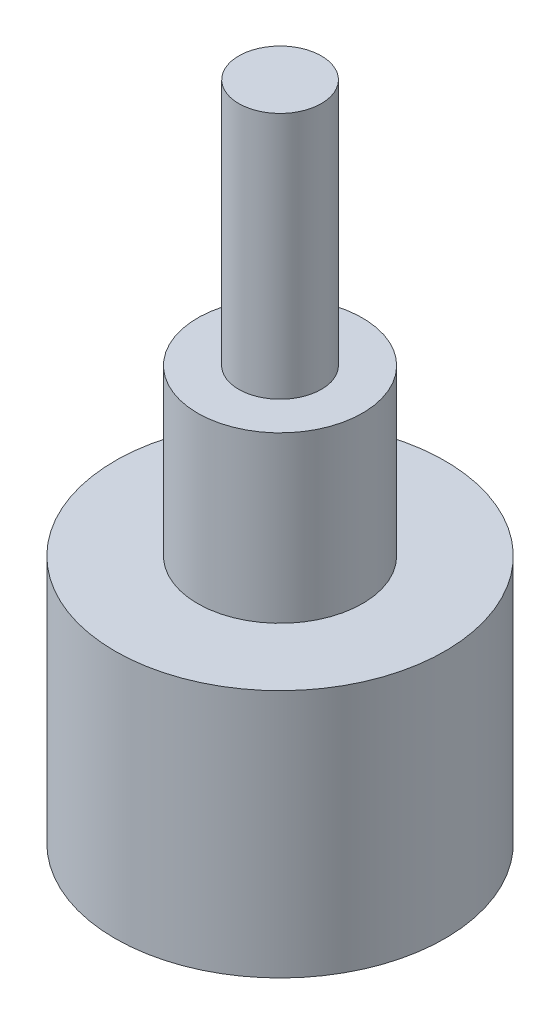
ISO-10303-21;
HEADER;
FILE_DESCRIPTION(('STEP AP214'),'2;1');
FILE_NAME('part.step','',(''),(''),'','','');
FILE_SCHEMA(('AUTOMOTIVE_DESIGN { 1 0 10303 214 1 1 1 1 }'));
ENDSEC;
DATA;
#1=APPLICATION_CONTEXT('core data for automotive mechanical design processes');
#2=APPLICATION_PROTOCOL_DEFINITION('international standard','automotive_design',2000,#1);
#3=PRODUCT_CONTEXT('',#1,'mechanical');
#4=PRODUCT('Part','Part','',(#3));
#5=PRODUCT_RELATED_PRODUCT_CATEGORY('part','',(#4));
#6=PRODUCT_DEFINITION_FORMATION('','',#4);
#7=PRODUCT_DEFINITION_CONTEXT('part definition',#1,'design');
#8=PRODUCT_DEFINITION('design','',#6,#7);
#9=PRODUCT_DEFINITION_SHAPE('','',#8);
#10=(LENGTH_UNIT() NAMED_UNIT(*) SI_UNIT(.MILLI.,.METRE.));
#11=(NAMED_UNIT(*) PLANE_ANGLE_UNIT() SI_UNIT($,.RADIAN.));
#12=(NAMED_UNIT(*) SI_UNIT($,.STERADIAN.) SOLID_ANGLE_UNIT());
#13=UNCERTAINTY_MEASURE_WITH_UNIT(LENGTH_MEASURE(1.E-05),#10,'distance_accuracy_value','');
#14=(GEOMETRIC_REPRESENTATION_CONTEXT(3) GLOBAL_UNCERTAINTY_ASSIGNED_CONTEXT((#13)) GLOBAL_UNIT_ASSIGNED_CONTEXT((#10,
#11,#12)) REPRESENTATION_CONTEXT('',''));
#15=CARTESIAN_POINT('',(0.,0.,0.));
#16=DIRECTION('',(0.,0.,1.));
#17=DIRECTION('',(1.,0.,0.));
#18=AXIS2_PLACEMENT_3D('',#15,#16,#17);
#19=CARTESIAN_POINT('',(0.,15.93,0.));
#20=DIRECTION('',(0.,1.,0.));
#21=DIRECTION('',(0.,0.,1.));
#22=AXIS2_PLACEMENT_3D('',#19,#20,#21);
#23=PLANE('',#22);
#24=CARTESIAN_POINT('',(0.,15.93,0.));
#25=DIRECTION('',(0.,1.,0.));
#26=DIRECTION('',(0.,0.,1.));
#27=AXIS2_PLACEMENT_3D('',#24,#25,#26);
#28=CIRCLE('',#27,3.175);
#29=CARTESIAN_POINT('',(0.,15.93,3.175));
#30=VERTEX_POINT('',#29);
#31=EDGE_CURVE('E42',#30,#30,#28,.T.);
#32=ORIENTED_EDGE('',*,*,#31,.T.);
#33=EDGE_LOOP('',(#32));
#34=FACE_BOUND('',#33,.T.);
#35=CARTESIAN_POINT('',(0.,15.93,0.));
#36=DIRECTION('',(0.,1.,0.));
#37=DIRECTION('',(0.,0.,1.));
#38=AXIS2_PLACEMENT_3D('',#35,#36,#37);
#39=CIRCLE('',#38,1.59);
#40=CARTESIAN_POINT('',(0.,15.93,1.59));
#41=VERTEX_POINT('',#40);
#42=EDGE_CURVE('E50',#41,#41,#39,.T.);
#43=ORIENTED_EDGE('',*,*,#42,.F.);
#44=EDGE_LOOP('',(#43));
#45=FACE_BOUND('',#44,.T.);
#46=ADVANCED_FACE('F31',(#34,#45),#23,.T.);
#47=CARTESIAN_POINT('',(0.,9.58,0.));
#48=DIRECTION('',(0.,1.,0.));
#49=DIRECTION('',(0.,0.,1.));
#50=AXIS2_PLACEMENT_3D('',#47,#48,#49);
#51=PLANE('',#50);
#52=CARTESIAN_POINT('',(0.,9.58,0.));
#53=DIRECTION('',(0.,1.,0.));
#54=DIRECTION('',(0.,0.,1.));
#55=AXIS2_PLACEMENT_3D('',#52,#53,#54);
#56=CIRCLE('',#55,6.35);
#57=CARTESIAN_POINT('',(0.,9.58,6.35));
#58=VERTEX_POINT('',#57);
#59=EDGE_CURVE('E10',#58,#58,#56,.T.);
#60=ORIENTED_EDGE('',*,*,#59,.T.);
#61=EDGE_LOOP('',(#60));
#62=FACE_BOUND('',#61,.T.);
#63=CARTESIAN_POINT('',(0.,9.58,0.));
#64=DIRECTION('',(0.,1.,0.));
#65=DIRECTION('',(0.,0.,1.));
#66=AXIS2_PLACEMENT_3D('',#63,#64,#65);
#67=CIRCLE('',#66,3.175);
#68=CARTESIAN_POINT('',(0.,9.58,3.175));
#69=VERTEX_POINT('',#68);
#70=EDGE_CURVE('E44',#69,#69,#67,.T.);
#71=ORIENTED_EDGE('',*,*,#70,.F.);
#72=EDGE_LOOP('',(#71));
#73=FACE_BOUND('',#72,.T.);
#74=ADVANCED_FACE('F66',(#62,#73),#51,.T.);
#75=CARTESIAN_POINT('',(0.,9.58,0.));
#76=DIRECTION('',(0.,-1.,0.));
#77=DIRECTION('',(0.,0.,-1.));
#78=AXIS2_PLACEMENT_3D('',#75,#76,#77);
#79=CYLINDRICAL_SURFACE('',#78,6.35);
#80=ORIENTED_EDGE('',*,*,#59,.F.);
#81=EDGE_LOOP('',(#80));
#82=FACE_BOUND('',#81,.T.);
#83=CARTESIAN_POINT('',(0.,0.,0.));
#84=DIRECTION('',(0.,1.,0.));
#85=DIRECTION('',(0.,0.,1.));
#86=AXIS2_PLACEMENT_3D('',#83,#84,#85);
#87=CIRCLE('',#86,6.35);
#88=CARTESIAN_POINT('',(0.,0.,6.35));
#89=VERTEX_POINT('',#88);
#90=EDGE_CURVE('E35',#89,#89,#87,.T.);
#91=ORIENTED_EDGE('',*,*,#90,.T.);
#92=EDGE_LOOP('',(#91));
#93=FACE_BOUND('',#92,.T.);
#94=ADVANCED_FACE('F33',(#82,#93),#79,.T.);
#95=CARTESIAN_POINT('',(0.,0.,0.));
#96=DIRECTION('',(0.,1.,0.));
#97=DIRECTION('',(0.,0.,1.));
#98=AXIS2_PLACEMENT_3D('',#95,#96,#97);
#99=PLANE('',#98);
#100=ORIENTED_EDGE('',*,*,#90,.F.);
#101=EDGE_LOOP('',(#100));
#102=FACE_BOUND('',#101,.T.);
#103=ADVANCED_FACE('F76',(#102),#99,.F.);
#104=CARTESIAN_POINT('',(0.,15.93,0.));
#105=DIRECTION('',(0.,-1.,0.));
#106=DIRECTION('',(0.,0.,-1.));
#107=AXIS2_PLACEMENT_3D('',#104,#105,#106);
#108=CYLINDRICAL_SURFACE('',#107,3.175);
#109=ORIENTED_EDGE('',*,*,#31,.F.);
#110=EDGE_LOOP('',(#109));
#111=FACE_BOUND('',#110,.T.);
#112=ORIENTED_EDGE('',*,*,#70,.T.);
#113=EDGE_LOOP('',(#112));
#114=FACE_BOUND('',#113,.T.);
#115=ADVANCED_FACE('F61',(#111,#114),#108,.T.);
#116=CARTESIAN_POINT('',(0.,25.46,0.));
#117=DIRECTION('',(0.,-1.,0.));
#118=DIRECTION('',(0.,0.,-1.));
#119=AXIS2_PLACEMENT_3D('',#116,#117,#118);
#120=CYLINDRICAL_SURFACE('',#119,1.59);
#121=CARTESIAN_POINT('',(0.,25.46,0.));
#122=DIRECTION('',(0.,1.,0.));
#123=DIRECTION('',(0.,0.,1.));
#124=AXIS2_PLACEMENT_3D('',#121,#122,#123);
#125=CIRCLE('',#124,1.59);
#126=CARTESIAN_POINT('',(0.,25.46,1.59));
#127=VERTEX_POINT('',#126);
#128=EDGE_CURVE('E47',#127,#127,#125,.T.);
#129=ORIENTED_EDGE('',*,*,#128,.F.);
#130=EDGE_LOOP('',(#129));
#131=FACE_BOUND('',#130,.T.);
#132=ORIENTED_EDGE('',*,*,#42,.T.);
#133=EDGE_LOOP('',(#132));
#134=FACE_BOUND('',#133,.T.);
#135=ADVANCED_FACE('F58',(#131,#134),#120,.T.);
#136=CARTESIAN_POINT('',(0.,25.46,0.));
#137=DIRECTION('',(0.,1.,0.));
#138=DIRECTION('',(0.,0.,1.));
#139=AXIS2_PLACEMENT_3D('',#136,#137,#138);
#140=PLANE('',#139);
#141=ORIENTED_EDGE('',*,*,#128,.T.);
#142=EDGE_LOOP('',(#141));
#143=FACE_BOUND('',#142,.T.);
#144=ADVANCED_FACE('F56',(#143),#140,.T.);
#145=CLOSED_SHELL('',(#46,#74,#94,#103,#115,#135,#144));
#146=MANIFOLD_SOLID_BREP('B2',#145);
#147=ADVANCED_BREP_SHAPE_REPRESENTATION('',(#18,#146),#14);
#148=SHAPE_DEFINITION_REPRESENTATION(#9,#147);
ENDSEC;
END-ISO-10303-21;
